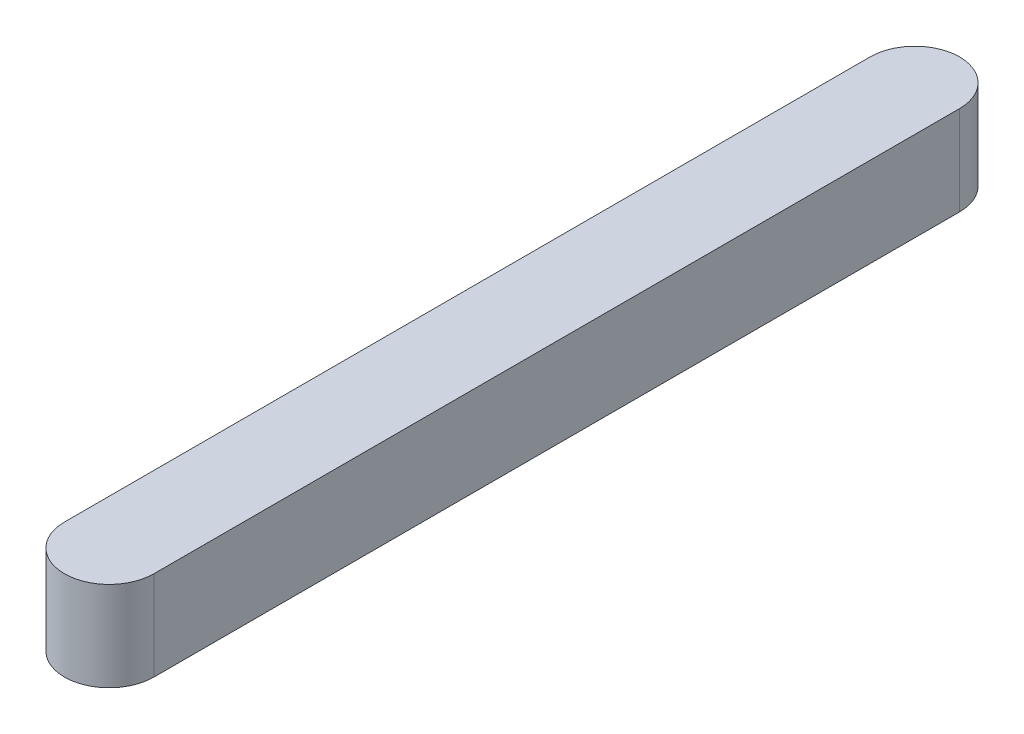
ISO-10303-21;
HEADER;
FILE_DESCRIPTION(('STEP AP214'),'2;1');
FILE_NAME('part.step','',(''),(''),'','','');
FILE_SCHEMA(('AUTOMOTIVE_DESIGN { 1 0 10303 214 1 1 1 1 }'));
ENDSEC;
DATA;
#1=APPLICATION_CONTEXT('core data for automotive mechanical design processes');
#2=APPLICATION_PROTOCOL_DEFINITION('international standard','automotive_design',2000,#1);
#3=PRODUCT_CONTEXT('',#1,'mechanical');
#4=PRODUCT('Part','Part','',(#3));
#5=PRODUCT_RELATED_PRODUCT_CATEGORY('part','',(#4));
#6=PRODUCT_DEFINITION_FORMATION('','',#4);
#7=PRODUCT_DEFINITION_CONTEXT('part definition',#1,'design');
#8=PRODUCT_DEFINITION('design','',#6,#7);
#9=PRODUCT_DEFINITION_SHAPE('','',#8);
#10=(LENGTH_UNIT() NAMED_UNIT(*) SI_UNIT(.MILLI.,.METRE.));
#11=(NAMED_UNIT(*) PLANE_ANGLE_UNIT() SI_UNIT($,.RADIAN.));
#12=(NAMED_UNIT(*) SI_UNIT($,.STERADIAN.) SOLID_ANGLE_UNIT());
#13=UNCERTAINTY_MEASURE_WITH_UNIT(LENGTH_MEASURE(1.E-05),#10,'distance_accuracy_value','');
#14=(GEOMETRIC_REPRESENTATION_CONTEXT(3) GLOBAL_UNCERTAINTY_ASSIGNED_CONTEXT((#13)) GLOBAL_UNIT_ASSIGNED_CONTEXT((#10,
#11,#12)) REPRESENTATION_CONTEXT('',''));
#15=CARTESIAN_POINT('',(0.,0.,0.));
#16=DIRECTION('',(0.,0.,1.));
#17=DIRECTION('',(1.,0.,0.));
#18=AXIS2_PLACEMENT_3D('',#15,#16,#17);
#19=CARTESIAN_POINT('',(-1.,1.,10.));
#20=DIRECTION('',(0.,-1.,0.));
#21=DIRECTION('',(0.,0.,-1.));
#22=AXIS2_PLACEMENT_3D('',#19,#20,#21);
#23=PLANE('',#22);
#24=CARTESIAN_POINT('',(0.,1.,-9.00000000000001));
#25=DIRECTION('',(0.,1.,0.));
#26=DIRECTION('',(0.,0.,1.));
#27=AXIS2_PLACEMENT_3D('',#24,#25,#26);
#28=CIRCLE('',#27,0.999999999999999);
#29=CARTESIAN_POINT('',(-1.,1.,-9.00000000000001));
#30=VERTEX_POINT('',#29);
#31=CARTESIAN_POINT('',(0.999999999999999,1.,-9.00000000000001));
#32=VERTEX_POINT('',#31);
#33=EDGE_CURVE('E83',#30,#32,#28,.F.);
#34=ORIENTED_EDGE('',*,*,#33,.F.);
#35=DIRECTION('',(0.,0.,-1.));
#36=VECTOR('',#35,1.);
#37=CARTESIAN_POINT('',(-1.,1.,10.));
#38=LINE('',#37,#36);
#39=CARTESIAN_POINT('',(-1.,1.,9.));
#40=VERTEX_POINT('',#39);
#41=EDGE_CURVE('E60',#30,#40,#38,.F.);
#42=ORIENTED_EDGE('',*,*,#41,.T.);
#43=CARTESIAN_POINT('',(0.,1.,9.));
#44=DIRECTION('',(0.,1.,0.));
#45=DIRECTION('',(0.,0.,1.));
#46=AXIS2_PLACEMENT_3D('',#43,#44,#45);
#47=CIRCLE('',#46,1.);
#48=CARTESIAN_POINT('',(1.,1.,9.));
#49=VERTEX_POINT('',#48);
#50=EDGE_CURVE('E21',#49,#40,#47,.F.);
#51=ORIENTED_EDGE('',*,*,#50,.F.);
#52=DIRECTION('',(0.,0.,1.));
#53=VECTOR('',#52,1.);
#54=CARTESIAN_POINT('',(1.,1.,10.));
#55=LINE('',#54,#53);
#56=EDGE_CURVE('E57',#49,#32,#55,.F.);
#57=ORIENTED_EDGE('',*,*,#56,.T.);
#58=EDGE_LOOP('',(#34,#42,#51,#57));
#59=FACE_BOUND('',#58,.T.);
#60=ADVANCED_FACE('F18',(#59),#23,.F.);
#61=CARTESIAN_POINT('',(0.,1.,9.));
#62=DIRECTION('',(0.,1.,0.));
#63=DIRECTION('',(0.,0.,1.));
#64=AXIS2_PLACEMENT_3D('',#61,#62,#63);
#65=CYLINDRICAL_SURFACE('',#64,1.);
#66=ORIENTED_EDGE('',*,*,#50,.T.);
#67=DIRECTION('',(0.,1.,0.));
#68=VECTOR('',#67,1.);
#69=CARTESIAN_POINT('',(-1.,-1.,9.));
#70=LINE('',#69,#68);
#71=CARTESIAN_POINT('',(-1.,-1.,9.));
#72=VERTEX_POINT('',#71);
#73=EDGE_CURVE('E84',#40,#72,#70,.F.);
#74=ORIENTED_EDGE('',*,*,#73,.T.);
#75=CARTESIAN_POINT('',(0.,-1.,9.));
#76=DIRECTION('',(0.,-1.,0.));
#77=DIRECTION('',(0.,0.,-1.));
#78=AXIS2_PLACEMENT_3D('',#75,#76,#77);
#79=CIRCLE('',#78,1.);
#80=CARTESIAN_POINT('',(1.,-1.,9.));
#81=VERTEX_POINT('',#80);
#82=EDGE_CURVE('E74',#72,#81,#79,.F.);
#83=ORIENTED_EDGE('',*,*,#82,.T.);
#84=DIRECTION('',(0.,1.,0.));
#85=VECTOR('',#84,1.);
#86=CARTESIAN_POINT('',(1.,-1.,9.));
#87=LINE('',#86,#85);
#88=EDGE_CURVE('E65',#81,#49,#87,.T.);
#89=ORIENTED_EDGE('',*,*,#88,.T.);
#90=EDGE_LOOP('',(#66,#74,#83,#89));
#91=FACE_BOUND('',#90,.T.);
#92=ADVANCED_FACE('F73',(#91),#65,.T.);
#93=CARTESIAN_POINT('',(1.,-1.,10.));
#94=DIRECTION('',(-1.,0.,0.));
#95=DIRECTION('',(0.,0.,1.));
#96=AXIS2_PLACEMENT_3D('',#93,#94,#95);
#97=PLANE('',#96);
#98=DIRECTION('',(0.,-1.,0.));
#99=VECTOR('',#98,1.);
#100=CARTESIAN_POINT('',(0.999999999999999,-1.,-9.00000000000001));
#101=LINE('',#100,#99);
#102=CARTESIAN_POINT('',(0.999999999999999,-1.,-9.00000000000001));
#103=VERTEX_POINT('',#102);
#104=EDGE_CURVE('E71',#32,#103,#101,.T.);
#105=ORIENTED_EDGE('',*,*,#104,.F.);
#106=ORIENTED_EDGE('',*,*,#56,.F.);
#107=ORIENTED_EDGE('',*,*,#88,.F.);
#108=DIRECTION('',(0.,0.,1.));
#109=VECTOR('',#108,1.);
#110=CARTESIAN_POINT('',(1.,-1.,10.));
#111=LINE('',#110,#109);
#112=EDGE_CURVE('E82',#81,#103,#111,.F.);
#113=ORIENTED_EDGE('',*,*,#112,.T.);
#114=EDGE_LOOP('',(#105,#106,#107,#113));
#115=FACE_BOUND('',#114,.T.);
#116=ADVANCED_FACE('F68',(#115),#97,.F.);
#117=CARTESIAN_POINT('',(0.,-1.,-9.00000000000001));
#118=DIRECTION('',(0.,1.,0.));
#119=DIRECTION('',(0.,0.,1.));
#120=AXIS2_PLACEMENT_3D('',#117,#118,#119);
#121=CYLINDRICAL_SURFACE('',#120,0.999999999999999);
#122=CARTESIAN_POINT('',(0.,-1.,-9.00000000000001));
#123=DIRECTION('',(0.,-1.,0.));
#124=DIRECTION('',(0.,0.,-1.));
#125=AXIS2_PLACEMENT_3D('',#122,#123,#124);
#126=CIRCLE('',#125,0.999999999999999);
#127=CARTESIAN_POINT('',(-1.,-1.,-9.00000000000001));
#128=VERTEX_POINT('',#127);
#129=EDGE_CURVE('E27',#103,#128,#126,.F.);
#130=ORIENTED_EDGE('',*,*,#129,.T.);
#131=DIRECTION('',(0.,1.,0.));
#132=VECTOR('',#131,1.);
#133=CARTESIAN_POINT('',(-1.,-1.,-9.));
#134=LINE('',#133,#132);
#135=EDGE_CURVE('E79',#128,#30,#134,.T.);
#136=ORIENTED_EDGE('',*,*,#135,.T.);
#137=ORIENTED_EDGE('',*,*,#33,.T.);
#138=ORIENTED_EDGE('',*,*,#104,.T.);
#139=EDGE_LOOP('',(#130,#136,#137,#138));
#140=FACE_BOUND('',#139,.T.);
#141=ADVANCED_FACE('F85',(#140),#121,.T.);
#142=CARTESIAN_POINT('',(-1.,-1.,10.));
#143=DIRECTION('',(1.,0.,0.));
#144=DIRECTION('',(0.,0.,-1.));
#145=AXIS2_PLACEMENT_3D('',#142,#143,#144);
#146=PLANE('',#145);
#147=ORIENTED_EDGE('',*,*,#135,.F.);
#148=DIRECTION('',(0.,0.,1.));
#149=VECTOR('',#148,1.);
#150=CARTESIAN_POINT('',(-1.,-1.,10.));
#151=LINE('',#150,#149);
#152=EDGE_CURVE('E11',#128,#72,#151,.T.);
#153=ORIENTED_EDGE('',*,*,#152,.T.);
#154=ORIENTED_EDGE('',*,*,#73,.F.);
#155=ORIENTED_EDGE('',*,*,#41,.F.);
#156=EDGE_LOOP('',(#147,#153,#154,#155));
#157=FACE_BOUND('',#156,.T.);
#158=ADVANCED_FACE('F92',(#157),#146,.F.);
#159=CARTESIAN_POINT('',(-1.,-1.,10.));
#160=DIRECTION('',(0.,1.,0.));
#161=DIRECTION('',(0.,0.,1.));
#162=AXIS2_PLACEMENT_3D('',#159,#160,#161);
#163=PLANE('',#162);
#164=ORIENTED_EDGE('',*,*,#152,.F.);
#165=ORIENTED_EDGE('',*,*,#129,.F.);
#166=ORIENTED_EDGE('',*,*,#112,.F.);
#167=ORIENTED_EDGE('',*,*,#82,.F.);
#168=EDGE_LOOP('',(#164,#165,#166,#167));
#169=FACE_BOUND('',#168,.T.);
#170=ADVANCED_FACE('F88',(#169),#163,.F.);
#171=CLOSED_SHELL('',(#60,#92,#116,#141,#158,#170));
#172=MANIFOLD_SOLID_BREP('B1',#171);
#173=ADVANCED_BREP_SHAPE_REPRESENTATION('',(#18,#172),#14);
#174=SHAPE_DEFINITION_REPRESENTATION(#9,#173);
ENDSEC;
END-ISO-10303-21;
